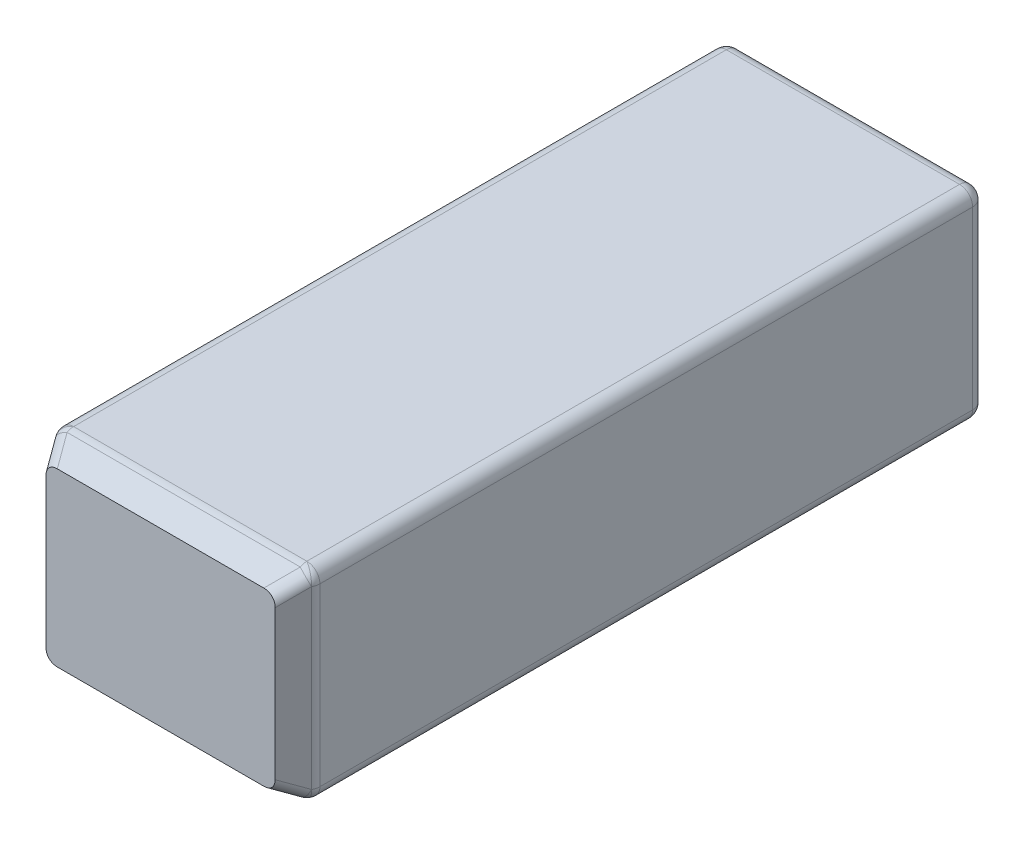
ISO-10303-21;
HEADER;
FILE_DESCRIPTION(('STEP AP214'),'2;1');
FILE_NAME('part.step','',(''),(''),'','','');
FILE_SCHEMA(('AUTOMOTIVE_DESIGN { 1 0 10303 214 1 1 1 1 }'));
ENDSEC;
DATA;
#1=APPLICATION_CONTEXT('core data for automotive mechanical design processes');
#2=APPLICATION_PROTOCOL_DEFINITION('international standard','automotive_design',2000,#1);
#3=PRODUCT_CONTEXT('',#1,'mechanical');
#4=PRODUCT('Part','Part','',(#3));
#5=PRODUCT_RELATED_PRODUCT_CATEGORY('part','',(#4));
#6=PRODUCT_DEFINITION_FORMATION('','',#4);
#7=PRODUCT_DEFINITION_CONTEXT('part definition',#1,'design');
#8=PRODUCT_DEFINITION('design','',#6,#7);
#9=PRODUCT_DEFINITION_SHAPE('','',#8);
#10=(LENGTH_UNIT() NAMED_UNIT(*) SI_UNIT(.MILLI.,.METRE.));
#11=(NAMED_UNIT(*) PLANE_ANGLE_UNIT() SI_UNIT($,.RADIAN.));
#12=(NAMED_UNIT(*) SI_UNIT($,.STERADIAN.) SOLID_ANGLE_UNIT());
#13=UNCERTAINTY_MEASURE_WITH_UNIT(LENGTH_MEASURE(1.E-05),#10,'distance_accuracy_value','');
#14=(GEOMETRIC_REPRESENTATION_CONTEXT(3) GLOBAL_UNCERTAINTY_ASSIGNED_CONTEXT((#13)) GLOBAL_UNIT_ASSIGNED_CONTEXT((#10,
#11,#12)) REPRESENTATION_CONTEXT('',''));
#15=CARTESIAN_POINT('',(0.,0.,0.));
#16=DIRECTION('',(0.,0.,1.));
#17=DIRECTION('',(1.,0.,0.));
#18=AXIS2_PLACEMENT_3D('',#15,#16,#17);
#19=CARTESIAN_POINT('',(31.496,-24.511,168.91));
#20=DIRECTION('',(-1.,0.,0.));
#21=DIRECTION('',(0.,0.,1.));
#22=AXIS2_PLACEMENT_3D('',#19,#20,#21);
#23=PLANE('',#22);
#24=DIRECTION('',(0.,0.,-1.));
#25=VECTOR('',#24,1.);
#26=CARTESIAN_POINT('',(31.496,-21.336,168.91));
#27=LINE('',#26,#25);
#28=CARTESIAN_POINT('',(31.496,-21.336,161.709261314031));
#29=VERTEX_POINT('',#28);
#30=CARTESIAN_POINT('',(31.496,-21.336,3.17500000000001));
#31=VERTEX_POINT('',#30);
#32=EDGE_CURVE('E231',#29,#31,#27,.T.);
#33=ORIENTED_EDGE('',*,*,#32,.T.);
#34=DIRECTION('',(0.,1.,0.));
#35=VECTOR('',#34,1.);
#36=CARTESIAN_POINT('',(31.496,21.336,3.17500000000001));
#37=LINE('',#36,#35);
#38=CARTESIAN_POINT('',(31.496,21.336,3.17500000000001));
#39=VERTEX_POINT('',#38);
#40=EDGE_CURVE('E11',#31,#39,#37,.T.);
#41=ORIENTED_EDGE('',*,*,#40,.T.);
#42=DIRECTION('',(0.,0.,-1.));
#43=VECTOR('',#42,1.);
#44=CARTESIAN_POINT('',(31.496,21.336,168.91));
#45=LINE('',#44,#43);
#46=CARTESIAN_POINT('',(31.496,21.336,161.709261314031));
#47=VERTEX_POINT('',#46);
#48=EDGE_CURVE('E228',#39,#47,#45,.F.);
#49=ORIENTED_EDGE('',*,*,#48,.T.);
#50=DIRECTION('',(0.,1.,0.));
#51=VECTOR('',#50,1.);
#52=CARTESIAN_POINT('',(31.496,-21.336,161.709261314031));
#53=LINE('',#52,#51);
#54=EDGE_CURVE('E54',#47,#29,#53,.F.);
#55=ORIENTED_EDGE('',*,*,#54,.T.);
#56=EDGE_LOOP('',(#33,#41,#49,#55));
#57=FACE_BOUND('',#56,.T.);
#58=ADVANCED_FACE('F45',(#57),#23,.F.);
#59=CARTESIAN_POINT('',(-31.496,24.511,168.91));
#60=DIRECTION('',(0.,-1.,0.));
#61=DIRECTION('',(0.,0.,-1.));
#62=AXIS2_PLACEMENT_3D('',#59,#60,#61);
#63=PLANE('',#62);
#64=DIRECTION('',(0.,0.,-1.));
#65=VECTOR('',#64,1.);
#66=CARTESIAN_POINT('',(28.321,24.511,168.91));
#67=LINE('',#66,#65);
#68=CARTESIAN_POINT('',(28.321,24.511,161.709261314031));
#69=VERTEX_POINT('',#68);
#70=CARTESIAN_POINT('',(28.321,24.511,3.17500000000001));
#71=VERTEX_POINT('',#70);
#72=EDGE_CURVE('E239',#69,#71,#67,.T.);
#73=ORIENTED_EDGE('',*,*,#72,.T.);
#74=DIRECTION('',(-1.,0.,0.));
#75=VECTOR('',#74,1.);
#76=CARTESIAN_POINT('',(-31.496,24.511,3.17500000000001));
#77=LINE('',#76,#75);
#78=CARTESIAN_POINT('',(-28.321,24.511,3.17500000000001));
#79=VERTEX_POINT('',#78);
#80=EDGE_CURVE('E242',#71,#79,#77,.T.);
#81=ORIENTED_EDGE('',*,*,#80,.T.);
#82=DIRECTION('',(0.,0.,-1.));
#83=VECTOR('',#82,1.);
#84=CARTESIAN_POINT('',(-28.321,24.511,168.91));
#85=LINE('',#84,#83);
#86=CARTESIAN_POINT('',(-28.321,24.511,161.709261314031));
#87=VERTEX_POINT('',#86);
#88=EDGE_CURVE('E233',#79,#87,#85,.F.);
#89=ORIENTED_EDGE('',*,*,#88,.T.);
#90=DIRECTION('',(-1.,0.,0.));
#91=VECTOR('',#90,1.);
#92=CARTESIAN_POINT('',(31.496,24.511,161.709261314031));
#93=LINE('',#92,#91);
#94=EDGE_CURVE('E236',#87,#69,#93,.F.);
#95=ORIENTED_EDGE('',*,*,#94,.T.);
#96=EDGE_LOOP('',(#73,#81,#89,#95));
#97=FACE_BOUND('',#96,.T.);
#98=ADVANCED_FACE('F465',(#97),#63,.F.);
#99=CARTESIAN_POINT('',(-31.496,-24.511,168.91));
#100=DIRECTION('',(1.,0.,0.));
#101=DIRECTION('',(0.,0.,-1.));
#102=AXIS2_PLACEMENT_3D('',#99,#100,#101);
#103=PLANE('',#102);
#104=DIRECTION('',(0.,0.,-1.));
#105=VECTOR('',#104,1.);
#106=CARTESIAN_POINT('',(-31.496,-21.336,168.91));
#107=LINE('',#106,#105);
#108=CARTESIAN_POINT('',(-31.496,-21.336,3.17500000000001));
#109=VERTEX_POINT('',#108);
#110=CARTESIAN_POINT('',(-31.496,-21.336,161.709261314031));
#111=VERTEX_POINT('',#110);
#112=EDGE_CURVE('E222',#109,#111,#107,.F.);
#113=ORIENTED_EDGE('',*,*,#112,.T.);
#114=DIRECTION('',(0.,-1.,0.));
#115=VECTOR('',#114,1.);
#116=CARTESIAN_POINT('',(-31.496,21.336,161.709261314031));
#117=LINE('',#116,#115);
#118=CARTESIAN_POINT('',(-31.496,21.336,161.709261314031));
#119=VERTEX_POINT('',#118);
#120=EDGE_CURVE('E298',#111,#119,#117,.F.);
#121=ORIENTED_EDGE('',*,*,#120,.T.);
#122=DIRECTION('',(0.,0.,-1.));
#123=VECTOR('',#122,1.);
#124=CARTESIAN_POINT('',(-31.496,21.336,168.91));
#125=LINE('',#124,#123);
#126=CARTESIAN_POINT('',(-31.496,21.336,3.17500000000001));
#127=VERTEX_POINT('',#126);
#128=EDGE_CURVE('E219',#119,#127,#125,.T.);
#129=ORIENTED_EDGE('',*,*,#128,.T.);
#130=DIRECTION('',(0.,-1.,0.));
#131=VECTOR('',#130,1.);
#132=CARTESIAN_POINT('',(-31.496,-21.336,3.17500000000001));
#133=LINE('',#132,#131);
#134=EDGE_CURVE('E296',#127,#109,#133,.T.);
#135=ORIENTED_EDGE('',*,*,#134,.T.);
#136=EDGE_LOOP('',(#113,#121,#129,#135));
#137=FACE_BOUND('',#136,.T.);
#138=ADVANCED_FACE('F418',(#137),#103,.F.);
#139=CARTESIAN_POINT('',(-31.496,-24.511,168.91));
#140=DIRECTION('',(0.,1.,0.));
#141=DIRECTION('',(0.,0.,1.));
#142=AXIS2_PLACEMENT_3D('',#139,#140,#141);
#143=PLANE('',#142);
#144=DIRECTION('',(0.,0.,-1.));
#145=VECTOR('',#144,1.);
#146=CARTESIAN_POINT('',(-28.321,-24.511,168.91));
#147=LINE('',#146,#145);
#148=CARTESIAN_POINT('',(-28.321,-24.511,161.709261314031));
#149=VERTEX_POINT('',#148);
#150=CARTESIAN_POINT('',(-28.321,-24.511,3.17500000000001));
#151=VERTEX_POINT('',#150);
#152=EDGE_CURVE('E210',#149,#151,#147,.T.);
#153=ORIENTED_EDGE('',*,*,#152,.T.);
#154=DIRECTION('',(1.,0.,0.));
#155=VECTOR('',#154,1.);
#156=CARTESIAN_POINT('',(31.496,-24.511,3.17500000000001));
#157=LINE('',#156,#155);
#158=CARTESIAN_POINT('',(28.321,-24.511,3.17500000000001));
#159=VERTEX_POINT('',#158);
#160=EDGE_CURVE('E190',#151,#159,#157,.T.);
#161=ORIENTED_EDGE('',*,*,#160,.T.);
#162=DIRECTION('',(0.,0.,-1.));
#163=VECTOR('',#162,1.);
#164=CARTESIAN_POINT('',(28.321,-24.511,168.91));
#165=LINE('',#164,#163);
#166=CARTESIAN_POINT('',(28.321,-24.511,161.709261314031));
#167=VERTEX_POINT('',#166);
#168=EDGE_CURVE('E198',#159,#167,#165,.F.);
#169=ORIENTED_EDGE('',*,*,#168,.T.);
#170=DIRECTION('',(1.,0.,0.));
#171=VECTOR('',#170,1.);
#172=CARTESIAN_POINT('',(-31.496,-24.511,161.709261314031));
#173=LINE('',#172,#171);
#174=EDGE_CURVE('E204',#167,#149,#173,.F.);
#175=ORIENTED_EDGE('',*,*,#174,.T.);
#176=EDGE_LOOP('',(#153,#161,#169,#175));
#177=FACE_BOUND('',#176,.T.);
#178=ADVANCED_FACE('F208',(#177),#143,.F.);
#179=CARTESIAN_POINT('',(0.,0.,168.91));
#180=DIRECTION('',(0.,0.,-1.));
#181=DIRECTION('',(-1.,0.,0.));
#182=AXIS2_PLACEMENT_3D('',#179,#180,#181);
#183=PLANE('',#182);
#184=DIRECTION('',(0.,-1.,0.));
#185=VECTOR('',#184,1.);
#186=CARTESIAN_POINT('',(-27.8298257906459,0.,168.91));
#187=LINE('',#186,#185);
#188=CARTESIAN_POINT('',(-27.8298257906459,18.0951951336303,168.91));
#189=VERTEX_POINT('',#188);
#190=CARTESIAN_POINT('',(-27.8298257906459,-18.0951951336303,168.91));
#191=VERTEX_POINT('',#190);
#192=EDGE_CURVE('E371',#189,#191,#187,.T.);
#193=ORIENTED_EDGE('',*,*,#192,.T.);
#194=CARTESIAN_POINT('',(-24.1636515812917,-17.1786515812918,168.91));
#195=DIRECTION('',(0.,0.,-1.));
#196=DIRECTION('',(0.707106781186548,0.707106781186548,0.));
#197=AXIS2_PLACEMENT_3D('',#194,#195,#196);
#198=ELLIPSE('',#197,4.09890737473618,3.175);
#199=CARTESIAN_POINT('',(-25.0801951336303,-20.8448257906459,168.91));
#200=VERTEX_POINT('',#199);
#201=EDGE_CURVE('E261',#191,#200,#198,.F.);
#202=ORIENTED_EDGE('',*,*,#201,.T.);
#203=DIRECTION('',(1.,0.,0.));
#204=VECTOR('',#203,1.);
#205=CARTESIAN_POINT('',(0.,-20.8448257906459,168.91));
#206=LINE('',#205,#204);
#207=CARTESIAN_POINT('',(25.0801951336303,-20.8448257906459,168.91));
#208=VERTEX_POINT('',#207);
#209=EDGE_CURVE('E205',#200,#208,#206,.T.);
#210=ORIENTED_EDGE('',*,*,#209,.T.);
#211=CARTESIAN_POINT('',(24.1636515812918,-17.1786515812918,168.91));
#212=DIRECTION('',(0.,0.,-1.));
#213=DIRECTION('',(-0.707106781186548,0.707106781186548,0.));
#214=AXIS2_PLACEMENT_3D('',#211,#212,#213);
#215=ELLIPSE('',#214,4.09890737473618,3.175);
#216=CARTESIAN_POINT('',(27.8298257906459,-18.0951951336303,168.91));
#217=VERTEX_POINT('',#216);
#218=EDGE_CURVE('E255',#208,#217,#215,.F.);
#219=ORIENTED_EDGE('',*,*,#218,.T.);
#220=DIRECTION('',(0.,1.,0.));
#221=VECTOR('',#220,1.);
#222=CARTESIAN_POINT('',(27.8298257906459,0.,168.91));
#223=LINE('',#222,#221);
#224=CARTESIAN_POINT('',(27.8298257906459,18.0951951336303,168.91));
#225=VERTEX_POINT('',#224);
#226=EDGE_CURVE('E328',#217,#225,#223,.T.);
#227=ORIENTED_EDGE('',*,*,#226,.T.);
#228=CARTESIAN_POINT('',(24.1636515812918,17.1786515812918,168.91));
#229=DIRECTION('',(0.,0.,-1.));
#230=DIRECTION('',(-0.707106781186548,-0.707106781186548,0.));
#231=AXIS2_PLACEMENT_3D('',#228,#229,#230);
#232=ELLIPSE('',#231,4.09890737473618,3.175);
#233=CARTESIAN_POINT('',(25.0801951336303,20.8448257906459,168.91));
#234=VERTEX_POINT('',#233);
#235=EDGE_CURVE('E257',#225,#234,#232,.F.);
#236=ORIENTED_EDGE('',*,*,#235,.T.);
#237=DIRECTION('',(-1.,0.,0.));
#238=VECTOR('',#237,1.);
#239=CARTESIAN_POINT('',(0.,20.8448257906459,168.91));
#240=LINE('',#239,#238);
#241=CARTESIAN_POINT('',(-25.0801951336303,20.8448257906459,168.91));
#242=VERTEX_POINT('',#241);
#243=EDGE_CURVE('E373',#234,#242,#240,.T.);
#244=ORIENTED_EDGE('',*,*,#243,.T.);
#245=CARTESIAN_POINT('',(-24.1636515812917,17.1786515812917,168.91));
#246=DIRECTION('',(0.,0.,-1.));
#247=DIRECTION('',(0.707106781186548,-0.707106781186548,0.));
#248=AXIS2_PLACEMENT_3D('',#245,#246,#247);
#249=ELLIPSE('',#248,4.09890737473618,3.175);
#250=EDGE_CURVE('E259',#242,#189,#249,.F.);
#251=ORIENTED_EDGE('',*,*,#250,.T.);
#252=EDGE_LOOP('',(#193,#202,#210,#219,#227,#236,#244,#251));
#253=FACE_BOUND('',#252,.T.);
#254=ADVANCED_FACE('F369',(#253),#183,.F.);
#255=CARTESIAN_POINT('',(0.,0.,0.));
#256=DIRECTION('',(0.,0.,-1.));
#257=DIRECTION('',(-1.,0.,0.));
#258=AXIS2_PLACEMENT_3D('',#255,#256,#257);
#259=PLANE('',#258);
#260=DIRECTION('',(1.,0.,0.));
#261=VECTOR('',#260,1.);
#262=CARTESIAN_POINT('',(-31.496,-21.336,0.));
#263=LINE('',#262,#261);
#264=CARTESIAN_POINT('',(28.321,-21.336,0.));
#265=VERTEX_POINT('',#264);
#266=CARTESIAN_POINT('',(-28.321,-21.336,0.));
#267=VERTEX_POINT('',#266);
#268=EDGE_CURVE('E193',#265,#267,#263,.F.);
#269=ORIENTED_EDGE('',*,*,#268,.T.);
#270=DIRECTION('',(0.,-1.,0.));
#271=VECTOR('',#270,1.);
#272=CARTESIAN_POINT('',(-28.321,21.336,0.));
#273=LINE('',#272,#271);
#274=CARTESIAN_POINT('',(-28.321,21.336,0.));
#275=VERTEX_POINT('',#274);
#276=EDGE_CURVE('E306',#267,#275,#273,.F.);
#277=ORIENTED_EDGE('',*,*,#276,.T.);
#278=DIRECTION('',(-1.,0.,0.));
#279=VECTOR('',#278,1.);
#280=CARTESIAN_POINT('',(31.496,21.336,0.));
#281=LINE('',#280,#279);
#282=CARTESIAN_POINT('',(28.321,21.336,0.));
#283=VERTEX_POINT('',#282);
#284=EDGE_CURVE('E211',#275,#283,#281,.F.);
#285=ORIENTED_EDGE('',*,*,#284,.T.);
#286=DIRECTION('',(0.,1.,0.));
#287=VECTOR('',#286,1.);
#288=CARTESIAN_POINT('',(28.321,-21.336,0.));
#289=LINE('',#288,#287);
#290=EDGE_CURVE('E304',#283,#265,#289,.F.);
#291=ORIENTED_EDGE('',*,*,#290,.T.);
#292=EDGE_LOOP('',(#269,#277,#285,#291));
#293=FACE_BOUND('',#292,.T.);
#294=ADVANCED_FACE('F440',(#293),#259,.T.);
#295=CARTESIAN_POINT('',(0.,20.8448257906459,168.91));
#296=DIRECTION('',(0.,-0.866025403784439,-0.499999999999999));
#297=DIRECTION('',(-1.,0.,0.));
#298=AXIS2_PLACEMENT_3D('',#295,#296,#297);
#299=PLANE('',#298);
#300=DIRECTION('',(1.,0.,0.));
#301=VECTOR('',#300,1.);
#302=CARTESIAN_POINT('',(-31.496,24.0856306570156,163.296761314031));
#303=LINE('',#302,#301);
#304=CARTESIAN_POINT('',(28.321,24.0856306570156,163.296761314031));
#305=VERTEX_POINT('',#304);
#306=CARTESIAN_POINT('',(-28.321,24.0856306570156,163.296761314031));
#307=VERTEX_POINT('',#306);
#308=EDGE_CURVE('E245',#305,#307,#303,.F.);
#309=ORIENTED_EDGE('',*,*,#308,.T.);
#310=DIRECTION('',(-0.447213595499957,0.447213595499957,-0.774596669241484));
#311=VECTOR('',#310,1.);
#312=CARTESIAN_POINT('',(-20.0641561069042,15.8287867639198,177.598034447038));
#313=LINE('',#312,#311);
#314=EDGE_CURVE('E269',#307,#242,#313,.F.);
#315=ORIENTED_EDGE('',*,*,#314,.T.);
#316=ORIENTED_EDGE('',*,*,#243,.F.);
#317=DIRECTION('',(0.447213595499957,0.447213595499957,-0.774596669241484));
#318=VECTOR('',#317,1.);
#319=CARTESIAN_POINT('',(20.0641561069042,15.8287867639198,177.598034447038));
#320=LINE('',#319,#318);
#321=EDGE_CURVE('E267',#234,#305,#320,.T.);
#322=ORIENTED_EDGE('',*,*,#321,.T.);
#323=EDGE_LOOP('',(#309,#315,#316,#322));
#324=FACE_BOUND('',#323,.T.);
#325=ADVANCED_FACE('F492',(#324),#299,.F.);
#326=CARTESIAN_POINT('',(-27.8298257906459,0.,168.91));
#327=DIRECTION('',(0.866025403784439,0.,-0.499999999999999));
#328=DIRECTION('',(0.,-1.,0.));
#329=AXIS2_PLACEMENT_3D('',#326,#327,#328);
#330=PLANE('',#329);
#331=DIRECTION('',(0.,1.,0.));
#332=VECTOR('',#331,1.);
#333=CARTESIAN_POINT('',(-31.0706306570156,-21.336,163.296761314031));
#334=LINE('',#333,#332);
#335=CARTESIAN_POINT('',(-31.0706306570156,21.336,163.296761314031));
#336=VERTEX_POINT('',#335);
#337=CARTESIAN_POINT('',(-31.0706306570156,-21.336,163.296761314031));
#338=VERTEX_POINT('',#337);
#339=EDGE_CURVE('E248',#336,#338,#334,.F.);
#340=ORIENTED_EDGE('',*,*,#339,.T.);
#341=DIRECTION('',(-0.447213595499957,-0.447213595499957,-0.774596669241484));
#342=VECTOR('',#341,1.);
#343=CARTESIAN_POINT('',(-24.2107867639198,-14.4761561069042,175.178359468864));
#344=LINE('',#343,#342);
#345=EDGE_CURVE('E252',#338,#191,#344,.F.);
#346=ORIENTED_EDGE('',*,*,#345,.T.);
#347=ORIENTED_EDGE('',*,*,#192,.F.);
#348=DIRECTION('',(-0.447213595499957,0.447213595499957,-0.774596669241484));
#349=VECTOR('',#348,1.);
#350=CARTESIAN_POINT('',(-24.2107867639198,14.4761561069042,175.178359468864));
#351=LINE('',#350,#349);
#352=EDGE_CURVE('E250',#189,#336,#351,.T.);
#353=ORIENTED_EDGE('',*,*,#352,.T.);
#354=EDGE_LOOP('',(#340,#346,#347,#353));
#355=FACE_BOUND('',#354,.T.);
#356=ADVANCED_FACE('F395',(#355),#330,.F.);
#357=CARTESIAN_POINT('',(27.8298257906459,0.,168.91));
#358=DIRECTION('',(-0.866025403784439,0.,-0.499999999999999));
#359=DIRECTION('',(0.,1.,0.));
#360=AXIS2_PLACEMENT_3D('',#357,#358,#359);
#361=PLANE('',#360);
#362=DIRECTION('',(0.,-1.,0.));
#363=VECTOR('',#362,1.);
#364=CARTESIAN_POINT('',(31.0706306570156,21.336,163.296761314031));
#365=LINE('',#364,#363);
#366=CARTESIAN_POINT('',(31.0706306570156,-21.336,163.296761314031));
#367=VERTEX_POINT('',#366);
#368=CARTESIAN_POINT('',(31.0706306570156,21.336,163.296761314031));
#369=VERTEX_POINT('',#368);
#370=EDGE_CURVE('E62',#367,#369,#365,.F.);
#371=ORIENTED_EDGE('',*,*,#370,.T.);
#372=DIRECTION('',(0.447213595499957,0.447213595499957,-0.774596669241484));
#373=VECTOR('',#372,1.);
#374=CARTESIAN_POINT('',(24.2107867639198,14.4761561069042,175.178359468864));
#375=LINE('',#374,#373);
#376=EDGE_CURVE('E290',#369,#225,#375,.F.);
#377=ORIENTED_EDGE('',*,*,#376,.T.);
#378=ORIENTED_EDGE('',*,*,#226,.F.);
#379=DIRECTION('',(0.447213595499957,-0.447213595499957,-0.774596669241484));
#380=VECTOR('',#379,1.);
#381=CARTESIAN_POINT('',(24.2107867639198,-14.4761561069042,175.178359468864));
#382=LINE('',#381,#380);
#383=EDGE_CURVE('E67',#217,#367,#382,.T.);
#384=ORIENTED_EDGE('',*,*,#383,.T.);
#385=EDGE_LOOP('',(#371,#377,#378,#384));
#386=FACE_BOUND('',#385,.T.);
#387=ADVANCED_FACE('F481',(#386),#361,.F.);
#388=CARTESIAN_POINT('',(0.,-20.8448257906459,168.91));
#389=DIRECTION('',(0.,0.866025403784439,-0.499999999999999));
#390=DIRECTION('',(1.,0.,0.));
#391=AXIS2_PLACEMENT_3D('',#388,#389,#390);
#392=PLANE('',#391);
#393=ORIENTED_EDGE('',*,*,#209,.F.);
#394=DIRECTION('',(-0.447213595499957,-0.447213595499957,-0.774596669241484));
#395=VECTOR('',#394,1.);
#396=CARTESIAN_POINT('',(-20.0641561069042,-15.8287867639198,177.598034447038));
#397=LINE('',#396,#395);
#398=CARTESIAN_POINT('',(-28.321,-24.0856306570156,163.296761314031));
#399=VERTEX_POINT('',#398);
#400=EDGE_CURVE('E265',#200,#399,#397,.T.);
#401=ORIENTED_EDGE('',*,*,#400,.T.);
#402=DIRECTION('',(-1.,0.,0.));
#403=VECTOR('',#402,1.);
#404=CARTESIAN_POINT('',(31.496,-24.0856306570156,163.296761314031));
#405=LINE('',#404,#403);
#406=CARTESIAN_POINT('',(28.321,-24.0856306570156,163.296761314031));
#407=VERTEX_POINT('',#406);
#408=EDGE_CURVE('E225',#399,#407,#405,.F.);
#409=ORIENTED_EDGE('',*,*,#408,.T.);
#410=DIRECTION('',(0.447213595499957,-0.447213595499957,-0.774596669241484));
#411=VECTOR('',#410,1.);
#412=CARTESIAN_POINT('',(20.0641561069042,-15.8287867639198,177.598034447038));
#413=LINE('',#412,#411);
#414=EDGE_CURVE('E263',#407,#208,#413,.F.);
#415=ORIENTED_EDGE('',*,*,#414,.T.);
#416=EDGE_LOOP('',(#393,#401,#409,#415));
#417=FACE_BOUND('',#416,.T.);
#418=ADVANCED_FACE('F364',(#417),#392,.F.);
#419=CARTESIAN_POINT('',(-31.496,-21.336,161.709261314031));
#420=DIRECTION('',(-1.,0.,0.));
#421=DIRECTION('',(0.,0.,1.));
#422=AXIS2_PLACEMENT_3D('',#419,#420,#421);
#423=CYLINDRICAL_SURFACE('',#422,3.175);
#424=ORIENTED_EDGE('',*,*,#408,.F.);
#425=CARTESIAN_POINT('',(-28.321,-21.336,161.709261314031));
#426=DIRECTION('',(-1.,0.,0.));
#427=DIRECTION('',(0.,0.,1.));
#428=AXIS2_PLACEMENT_3D('',#425,#426,#427);
#429=CIRCLE('',#428,3.175);
#430=EDGE_CURVE('E294',#399,#149,#429,.F.);
#431=ORIENTED_EDGE('',*,*,#430,.T.);
#432=ORIENTED_EDGE('',*,*,#174,.F.);
#433=CARTESIAN_POINT('',(28.321,-21.336,161.709261314031));
#434=DIRECTION('',(-1.,0.,0.));
#435=DIRECTION('',(0.,0.,1.));
#436=AXIS2_PLACEMENT_3D('',#433,#434,#435);
#437=CIRCLE('',#436,3.175);
#438=EDGE_CURVE('E292',#167,#407,#437,.T.);
#439=ORIENTED_EDGE('',*,*,#438,.T.);
#440=EDGE_LOOP('',(#424,#431,#432,#439));
#441=FACE_BOUND('',#440,.T.);
#442=ADVANCED_FACE('F480',(#441),#423,.T.);
#443=CARTESIAN_POINT('',(-28.321,-21.336,168.91));
#444=DIRECTION('',(0.,0.,-1.));
#445=DIRECTION('',(-1.,0.,0.));
#446=AXIS2_PLACEMENT_3D('',#443,#444,#445);
#447=CYLINDRICAL_SURFACE('',#446,3.175);
#448=ORIENTED_EDGE('',*,*,#112,.F.);
#449=CARTESIAN_POINT('',(-28.321,-21.336,3.17500000000001));
#450=DIRECTION('',(0.,0.,-1.));
#451=DIRECTION('',(-1.,0.,0.));
#452=AXIS2_PLACEMENT_3D('',#449,#450,#451);
#453=CIRCLE('',#452,3.175);
#454=EDGE_CURVE('E282',#109,#151,#453,.F.);
#455=ORIENTED_EDGE('',*,*,#454,.T.);
#456=ORIENTED_EDGE('',*,*,#152,.F.);
#457=CARTESIAN_POINT('',(-28.321,-21.336,161.709261314031));
#458=DIRECTION('',(0.,0.,-1.));
#459=DIRECTION('',(-1.,0.,0.));
#460=AXIS2_PLACEMENT_3D('',#457,#458,#459);
#461=CIRCLE('',#460,3.175);
#462=EDGE_CURVE('E280',#149,#111,#461,.T.);
#463=ORIENTED_EDGE('',*,*,#462,.T.);
#464=EDGE_LOOP('',(#448,#455,#456,#463));
#465=FACE_BOUND('',#464,.T.);
#466=ADVANCED_FACE('F380',(#465),#447,.T.);
#467=CARTESIAN_POINT('',(28.321,-21.336,168.91));
#468=DIRECTION('',(0.,0.,-1.));
#469=DIRECTION('',(-1.,0.,0.));
#470=AXIS2_PLACEMENT_3D('',#467,#468,#469);
#471=CYLINDRICAL_SURFACE('',#470,3.175);
#472=ORIENTED_EDGE('',*,*,#168,.F.);
#473=CARTESIAN_POINT('',(28.321,-21.336,3.17500000000001));
#474=DIRECTION('',(0.,0.,-1.));
#475=DIRECTION('',(-1.,0.,0.));
#476=AXIS2_PLACEMENT_3D('',#473,#474,#475);
#477=CIRCLE('',#476,3.175);
#478=EDGE_CURVE('E172',#159,#31,#477,.F.);
#479=ORIENTED_EDGE('',*,*,#478,.T.);
#480=ORIENTED_EDGE('',*,*,#32,.F.);
#481=CARTESIAN_POINT('',(28.321,-21.336,161.709261314031));
#482=DIRECTION('',(0.,0.,-1.));
#483=DIRECTION('',(-1.,0.,0.));
#484=AXIS2_PLACEMENT_3D('',#481,#482,#483);
#485=CIRCLE('',#484,3.175);
#486=EDGE_CURVE('E183',#29,#167,#485,.T.);
#487=ORIENTED_EDGE('',*,*,#486,.T.);
#488=EDGE_LOOP('',(#472,#479,#480,#487));
#489=FACE_BOUND('',#488,.T.);
#490=ADVANCED_FACE('F199',(#489),#471,.T.);
#491=CARTESIAN_POINT('',(-31.496,-21.336,3.17500000000001));
#492=DIRECTION('',(-1.,0.,0.));
#493=DIRECTION('',(0.,0.,1.));
#494=AXIS2_PLACEMENT_3D('',#491,#492,#493);
#495=CYLINDRICAL_SURFACE('',#494,3.175);
#496=ORIENTED_EDGE('',*,*,#160,.F.);
#497=CARTESIAN_POINT('',(-28.321,-21.336,3.17500000000001));
#498=DIRECTION('',(-1.,0.,0.));
#499=DIRECTION('',(0.,0.,1.));
#500=AXIS2_PLACEMENT_3D('',#497,#498,#499);
#501=CIRCLE('',#500,3.175);
#502=EDGE_CURVE('E194',#151,#267,#501,.F.);
#503=ORIENTED_EDGE('',*,*,#502,.T.);
#504=ORIENTED_EDGE('',*,*,#268,.F.);
#505=CARTESIAN_POINT('',(28.321,-21.336,3.17500000000001));
#506=DIRECTION('',(-1.,0.,0.));
#507=DIRECTION('',(0.,0.,1.));
#508=AXIS2_PLACEMENT_3D('',#505,#506,#507);
#509=CIRCLE('',#508,3.175);
#510=EDGE_CURVE('E175',#265,#159,#509,.T.);
#511=ORIENTED_EDGE('',*,*,#510,.T.);
#512=EDGE_LOOP('',(#496,#503,#504,#511));
#513=FACE_BOUND('',#512,.T.);
#514=ADVANCED_FACE('F188',(#513),#495,.T.);
#515=CARTESIAN_POINT('',(-31.496,21.336,161.709261314031));
#516=DIRECTION('',(1.,0.,0.));
#517=DIRECTION('',(0.,0.,-1.));
#518=AXIS2_PLACEMENT_3D('',#515,#516,#517);
#519=CYLINDRICAL_SURFACE('',#518,3.175);
#520=ORIENTED_EDGE('',*,*,#94,.F.);
#521=CARTESIAN_POINT('',(-28.321,21.336,161.709261314031));
#522=DIRECTION('',(1.,0.,0.));
#523=DIRECTION('',(0.,0.,-1.));
#524=AXIS2_PLACEMENT_3D('',#521,#522,#523);
#525=CIRCLE('',#524,3.175);
#526=EDGE_CURVE('E302',#87,#307,#525,.T.);
#527=ORIENTED_EDGE('',*,*,#526,.T.);
#528=ORIENTED_EDGE('',*,*,#308,.F.);
#529=CARTESIAN_POINT('',(28.321,21.336,161.709261314031));
#530=DIRECTION('',(1.,0.,0.));
#531=DIRECTION('',(0.,0.,-1.));
#532=AXIS2_PLACEMENT_3D('',#529,#530,#531);
#533=CIRCLE('',#532,3.175);
#534=EDGE_CURVE('E300',#305,#69,#533,.F.);
#535=ORIENTED_EDGE('',*,*,#534,.T.);
#536=EDGE_LOOP('',(#520,#527,#528,#535));
#537=FACE_BOUND('',#536,.T.);
#538=ADVANCED_FACE('F500',(#537),#519,.T.);
#539=CARTESIAN_POINT('',(28.321,21.336,168.91));
#540=DIRECTION('',(0.,0.,-1.));
#541=DIRECTION('',(-1.,0.,0.));
#542=AXIS2_PLACEMENT_3D('',#539,#540,#541);
#543=CYLINDRICAL_SURFACE('',#542,3.175);
#544=ORIENTED_EDGE('',*,*,#48,.F.);
#545=CARTESIAN_POINT('',(28.321,21.336,3.17500000000001));
#546=DIRECTION('',(0.,0.,-1.));
#547=DIRECTION('',(-1.,0.,0.));
#548=AXIS2_PLACEMENT_3D('',#545,#546,#547);
#549=CIRCLE('',#548,3.175);
#550=EDGE_CURVE('E286',#39,#71,#549,.F.);
#551=ORIENTED_EDGE('',*,*,#550,.T.);
#552=ORIENTED_EDGE('',*,*,#72,.F.);
#553=CARTESIAN_POINT('',(28.321,21.336,161.709261314031));
#554=DIRECTION('',(0.,0.,-1.));
#555=DIRECTION('',(-1.,0.,0.));
#556=AXIS2_PLACEMENT_3D('',#553,#554,#555);
#557=CIRCLE('',#556,3.175);
#558=EDGE_CURVE('E182',#69,#47,#557,.T.);
#559=ORIENTED_EDGE('',*,*,#558,.T.);
#560=EDGE_LOOP('',(#544,#551,#552,#559));
#561=FACE_BOUND('',#560,.T.);
#562=ADVANCED_FACE('F450',(#561),#543,.T.);
#563=CARTESIAN_POINT('',(-28.321,21.336,168.91));
#564=DIRECTION('',(0.,0.,-1.));
#565=DIRECTION('',(-1.,0.,0.));
#566=AXIS2_PLACEMENT_3D('',#563,#564,#565);
#567=CYLINDRICAL_SURFACE('',#566,3.175);
#568=ORIENTED_EDGE('',*,*,#88,.F.);
#569=CARTESIAN_POINT('',(-28.321,21.336,3.17500000000001));
#570=DIRECTION('',(0.,0.,-1.));
#571=DIRECTION('',(-1.,0.,0.));
#572=AXIS2_PLACEMENT_3D('',#569,#570,#571);
#573=CIRCLE('',#572,3.175);
#574=EDGE_CURVE('E195',#79,#127,#573,.F.);
#575=ORIENTED_EDGE('',*,*,#574,.T.);
#576=ORIENTED_EDGE('',*,*,#128,.F.);
#577=CARTESIAN_POINT('',(-28.321,21.336,161.709261314031));
#578=DIRECTION('',(0.,0.,-1.));
#579=DIRECTION('',(-1.,0.,0.));
#580=AXIS2_PLACEMENT_3D('',#577,#578,#579);
#581=CIRCLE('',#580,3.175);
#582=EDGE_CURVE('E276',#119,#87,#581,.T.);
#583=ORIENTED_EDGE('',*,*,#582,.T.);
#584=EDGE_LOOP('',(#568,#575,#576,#583));
#585=FACE_BOUND('',#584,.T.);
#586=ADVANCED_FACE('F422',(#585),#567,.T.);
#587=CARTESIAN_POINT('',(-31.496,21.336,3.17500000000001));
#588=DIRECTION('',(1.,0.,0.));
#589=DIRECTION('',(0.,0.,-1.));
#590=AXIS2_PLACEMENT_3D('',#587,#588,#589);
#591=CYLINDRICAL_SURFACE('',#590,3.175);
#592=ORIENTED_EDGE('',*,*,#284,.F.);
#593=CARTESIAN_POINT('',(-28.321,21.336,3.17500000000001));
#594=DIRECTION('',(1.,0.,0.));
#595=DIRECTION('',(0.,0.,-1.));
#596=AXIS2_PLACEMENT_3D('',#593,#594,#595);
#597=CIRCLE('',#596,3.175);
#598=EDGE_CURVE('E273',#275,#79,#597,.T.);
#599=ORIENTED_EDGE('',*,*,#598,.T.);
#600=ORIENTED_EDGE('',*,*,#80,.F.);
#601=CARTESIAN_POINT('',(28.321,21.336,3.17500000000001));
#602=DIRECTION('',(1.,0.,0.));
#603=DIRECTION('',(0.,0.,-1.));
#604=AXIS2_PLACEMENT_3D('',#601,#602,#603);
#605=CIRCLE('',#604,3.175);
#606=EDGE_CURVE('E271',#71,#283,#605,.F.);
#607=ORIENTED_EDGE('',*,*,#606,.T.);
#608=EDGE_LOOP('',(#592,#599,#600,#607));
#609=FACE_BOUND('',#608,.T.);
#610=ADVANCED_FACE('F430',(#609),#591,.T.);
#611=CARTESIAN_POINT('',(-20.0641561069042,13.0791561069042,176.010534447038));
#612=DIRECTION('',(0.447213595499957,-0.447213595499957,0.774596669241484));
#613=DIRECTION('',(0.866025403784439,0.,-0.499999999999999));
#614=AXIS2_PLACEMENT_3D('',#611,#612,#613);
#615=CYLINDRICAL_SURFACE('',#614,3.175);
#616=ORIENTED_EDGE('',*,*,#250,.F.);
#617=ORIENTED_EDGE('',*,*,#314,.F.);
#618=CARTESIAN_POINT('',(-28.321,21.336,161.709261314031));
#619=DIRECTION('',(-0.447213595499956,0.447213595499956,-0.774596669241485));
#620=DIRECTION('',(-0.86602540378444,0.,0.499999999999998));
#621=AXIS2_PLACEMENT_3D('',#618,#619,#620);
#622=CIRCLE('',#621,3.175);
#623=EDGE_CURVE('E325',#336,#307,#622,.T.);
#624=ORIENTED_EDGE('',*,*,#623,.F.);
#625=ORIENTED_EDGE('',*,*,#352,.F.);
#626=EDGE_LOOP('',(#616,#617,#624,#625));
#627=FACE_BOUND('',#626,.T.);
#628=ADVANCED_FACE('F403',(#627),#615,.T.);
#629=CARTESIAN_POINT('',(-28.321,21.336,161.709261314031));
#630=DIRECTION('',(-0.866025403784439,0.,0.499999999999999));
#631=DIRECTION('',(0.499999999999999,0.,0.866025403784439));
#632=AXIS2_PLACEMENT_3D('',#629,#630,#631);
#633=SPHERICAL_SURFACE('',#632,3.175);
#634=ORIENTED_EDGE('',*,*,#623,.T.);
#635=ORIENTED_EDGE('',*,*,#526,.F.);
#636=CARTESIAN_POINT('',(-28.321,21.336,161.709261314031));
#637=DIRECTION('',(-0.499999999999998,0.,-0.86602540378444));
#638=DIRECTION('',(-0.86602540378444,0.,0.499999999999998));
#639=AXIS2_PLACEMENT_3D('',#636,#637,#638);
#640=CIRCLE('',#639,3.175);
#641=EDGE_CURVE('E322',#336,#87,#640,.T.);
#642=ORIENTED_EDGE('',*,*,#641,.F.);
#643=EDGE_LOOP('',(#634,#635,#642));
#644=FACE_BOUND('',#643,.T.);
#645=ADVANCED_FACE('F409',(#644),#633,.T.);
#646=CARTESIAN_POINT('',(-28.321,21.336,161.709261314031));
#647=DIRECTION('',(-0.866025403784439,0.,0.499999999999999));
#648=DIRECTION('',(0.499999999999999,0.,0.866025403784439));
#649=AXIS2_PLACEMENT_3D('',#646,#647,#648);
#650=SPHERICAL_SURFACE('',#649,3.175);
#651=ORIENTED_EDGE('',*,*,#641,.T.);
#652=ORIENTED_EDGE('',*,*,#582,.F.);
#653=CARTESIAN_POINT('',(-28.321,21.336,161.709261314031));
#654=DIRECTION('',(0.,-1.,0.));
#655=DIRECTION('',(0.,0.,-1.));
#656=AXIS2_PLACEMENT_3D('',#653,#654,#655);
#657=CIRCLE('',#656,3.175);
#658=EDGE_CURVE('E319',#336,#119,#657,.T.);
#659=ORIENTED_EDGE('',*,*,#658,.F.);
#660=EDGE_LOOP('',(#651,#652,#659));
#661=FACE_BOUND('',#660,.T.);
#662=ADVANCED_FACE('F412',(#661),#650,.T.);
#663=CARTESIAN_POINT('',(-28.321,-24.511,161.709261314031));
#664=DIRECTION('',(0.,1.,0.));
#665=DIRECTION('',(0.,0.,1.));
#666=AXIS2_PLACEMENT_3D('',#663,#664,#665);
#667=CYLINDRICAL_SURFACE('',#666,3.175);
#668=ORIENTED_EDGE('',*,*,#658,.T.);
#669=ORIENTED_EDGE('',*,*,#120,.F.);
#670=CARTESIAN_POINT('',(-28.321,-21.336,161.709261314031));
#671=DIRECTION('',(0.,-1.,0.));
#672=DIRECTION('',(0.,0.,-1.));
#673=AXIS2_PLACEMENT_3D('',#670,#671,#672);
#674=CIRCLE('',#673,3.175);
#675=EDGE_CURVE('E316',#338,#111,#674,.T.);
#676=ORIENTED_EDGE('',*,*,#675,.F.);
#677=ORIENTED_EDGE('',*,*,#339,.F.);
#678=EDGE_LOOP('',(#668,#669,#676,#677));
#679=FACE_BOUND('',#678,.T.);
#680=ADVANCED_FACE('F415',(#679),#667,.T.);
#681=CARTESIAN_POINT('',(-28.321,-21.336,161.709261314031));
#682=DIRECTION('',(-0.866025403784439,0.,0.499999999999999));
#683=DIRECTION('',(0.499999999999999,0.,0.866025403784439));
#684=AXIS2_PLACEMENT_3D('',#681,#682,#683);
#685=SPHERICAL_SURFACE('',#684,3.175);
#686=ORIENTED_EDGE('',*,*,#675,.T.);
#687=ORIENTED_EDGE('',*,*,#462,.F.);
#688=CARTESIAN_POINT('',(-28.321,-21.336,161.709261314031));
#689=DIRECTION('',(0.499999999999998,0.,0.86602540378444));
#690=DIRECTION('',(0.86602540378444,0.,-0.499999999999998));
#691=AXIS2_PLACEMENT_3D('',#688,#689,#690);
#692=CIRCLE('',#691,3.175);
#693=EDGE_CURVE('E312',#338,#149,#692,.T.);
#694=ORIENTED_EDGE('',*,*,#693,.F.);
#695=EDGE_LOOP('',(#686,#687,#694));
#696=FACE_BOUND('',#695,.T.);
#697=ADVANCED_FACE('F384',(#696),#685,.T.);
#698=CARTESIAN_POINT('',(-28.321,-21.336,161.709261314031));
#699=DIRECTION('',(-0.866025403784439,0.,0.499999999999999));
#700=DIRECTION('',(0.499999999999999,0.,0.866025403784439));
#701=AXIS2_PLACEMENT_3D('',#698,#699,#700);
#702=SPHERICAL_SURFACE('',#701,3.175);
#703=ORIENTED_EDGE('',*,*,#693,.T.);
#704=ORIENTED_EDGE('',*,*,#430,.F.);
#705=CARTESIAN_POINT('',(-28.321,-21.336,161.709261314031));
#706=DIRECTION('',(0.447213595499956,0.447213595499957,0.774596669241485));
#707=DIRECTION('',(0.,-0.86602540378444,0.499999999999998));
#708=AXIS2_PLACEMENT_3D('',#705,#706,#707);
#709=CIRCLE('',#708,3.175);
#710=EDGE_CURVE('E309',#338,#399,#709,.T.);
#711=ORIENTED_EDGE('',*,*,#710,.F.);
#712=EDGE_LOOP('',(#703,#704,#711));
#713=FACE_BOUND('',#712,.T.);
#714=ADVANCED_FACE('F389',(#713),#702,.T.);
#715=CARTESIAN_POINT('',(-21.4611561069042,-14.4761561069042,173.590859468864));
#716=DIRECTION('',(0.447213595499957,0.447213595499957,0.774596669241484));
#717=DIRECTION('',(0.866025403784439,0.,-0.499999999999999));
#718=AXIS2_PLACEMENT_3D('',#715,#716,#717);
#719=CYLINDRICAL_SURFACE('',#718,3.175);
#720=ORIENTED_EDGE('',*,*,#710,.T.);
#721=ORIENTED_EDGE('',*,*,#400,.F.);
#722=ORIENTED_EDGE('',*,*,#201,.F.);
#723=ORIENTED_EDGE('',*,*,#345,.F.);
#724=EDGE_LOOP('',(#720,#721,#722,#723));
#725=FACE_BOUND('',#724,.T.);
#726=ADVANCED_FACE('F392',(#725),#719,.T.);
#727=CARTESIAN_POINT('',(-28.321,-21.336,3.17500000000001));
#728=DIRECTION('',(0.,0.,1.));
#729=DIRECTION('',(1.,0.,0.));
#730=AXIS2_PLACEMENT_3D('',#727,#728,#729);
#731=SPHERICAL_SURFACE('',#730,3.175);
#732=ORIENTED_EDGE('',*,*,#502,.F.);
#733=ORIENTED_EDGE('',*,*,#454,.F.);
#734=CARTESIAN_POINT('',(-28.321,-21.336,3.17500000000001));
#735=DIRECTION('',(0.,1.,0.));
#736=DIRECTION('',(0.,0.,1.));
#737=AXIS2_PLACEMENT_3D('',#734,#735,#736);
#738=CIRCLE('',#737,3.175);
#739=EDGE_CURVE('E313',#267,#109,#738,.T.);
#740=ORIENTED_EDGE('',*,*,#739,.F.);
#741=EDGE_LOOP('',(#732,#733,#740));
#742=FACE_BOUND('',#741,.T.);
#743=ADVANCED_FACE('F439',(#742),#731,.T.);
#744=CARTESIAN_POINT('',(-28.321,-24.511,3.17500000000001));
#745=DIRECTION('',(0.,1.,0.));
#746=DIRECTION('',(0.,0.,1.));
#747=AXIS2_PLACEMENT_3D('',#744,#745,#746);
#748=CYLINDRICAL_SURFACE('',#747,3.175);
#749=ORIENTED_EDGE('',*,*,#739,.T.);
#750=ORIENTED_EDGE('',*,*,#134,.F.);
#751=CARTESIAN_POINT('',(-28.321,21.336,3.175));
#752=DIRECTION('',(0.,1.,0.));
#753=DIRECTION('',(-1.,0.,0.));
#754=AXIS2_PLACEMENT_3D('',#751,#752,#753);
#755=CIRCLE('',#754,3.175);
#756=EDGE_CURVE('E329',#275,#127,#755,.T.);
#757=ORIENTED_EDGE('',*,*,#756,.F.);
#758=ORIENTED_EDGE('',*,*,#276,.F.);
#759=EDGE_LOOP('',(#749,#750,#757,#758));
#760=FACE_BOUND('',#759,.T.);
#761=ADVANCED_FACE('F436',(#760),#748,.T.);
#762=CARTESIAN_POINT('',(-28.321,21.336,3.17500000000001));
#763=DIRECTION('',(0.,0.,1.));
#764=DIRECTION('',(1.,0.,0.));
#765=AXIS2_PLACEMENT_3D('',#762,#763,#764);
#766=SPHERICAL_SURFACE('',#765,3.175);
#767=ORIENTED_EDGE('',*,*,#756,.T.);
#768=ORIENTED_EDGE('',*,*,#574,.F.);
#769=ORIENTED_EDGE('',*,*,#598,.F.);
#770=EDGE_LOOP('',(#767,#768,#769));
#771=FACE_BOUND('',#770,.T.);
#772=ADVANCED_FACE('F425',(#771),#766,.T.);
#773=CARTESIAN_POINT('',(28.321,21.336,3.17500000000001));
#774=DIRECTION('',(0.,0.,1.));
#775=DIRECTION('',(1.,0.,0.));
#776=AXIS2_PLACEMENT_3D('',#773,#774,#775);
#777=SPHERICAL_SURFACE('',#776,3.175);
#778=ORIENTED_EDGE('',*,*,#606,.F.);
#779=ORIENTED_EDGE('',*,*,#550,.F.);
#780=CARTESIAN_POINT('',(28.321,21.336,3.17500000000001));
#781=DIRECTION('',(0.,-1.,0.));
#782=DIRECTION('',(1.,0.,0.));
#783=AXIS2_PLACEMENT_3D('',#780,#781,#782);
#784=CIRCLE('',#783,3.175);
#785=EDGE_CURVE('E332',#283,#39,#784,.T.);
#786=ORIENTED_EDGE('',*,*,#785,.F.);
#787=EDGE_LOOP('',(#778,#779,#786));
#788=FACE_BOUND('',#787,.T.);
#789=ADVANCED_FACE('F454',(#788),#777,.T.);
#790=CARTESIAN_POINT('',(28.321,-24.511,3.17500000000001));
#791=DIRECTION('',(0.,-1.,0.));
#792=DIRECTION('',(0.,0.,-1.));
#793=AXIS2_PLACEMENT_3D('',#790,#791,#792);
#794=CYLINDRICAL_SURFACE('',#793,3.175);
#795=ORIENTED_EDGE('',*,*,#785,.T.);
#796=ORIENTED_EDGE('',*,*,#40,.F.);
#797=CARTESIAN_POINT('',(28.321,-21.336,3.175));
#798=DIRECTION('',(0.,-1.,0.));
#799=DIRECTION('',(0.,0.,-1.));
#800=AXIS2_PLACEMENT_3D('',#797,#798,#799);
#801=CIRCLE('',#800,3.175);
#802=EDGE_CURVE('E177',#265,#31,#801,.T.);
#803=ORIENTED_EDGE('',*,*,#802,.F.);
#804=ORIENTED_EDGE('',*,*,#290,.F.);
#805=EDGE_LOOP('',(#795,#796,#803,#804));
#806=FACE_BOUND('',#805,.T.);
#807=ADVANCED_FACE('F443',(#806),#794,.T.);
#808=CARTESIAN_POINT('',(28.321,-21.336,3.17500000000001));
#809=DIRECTION('',(0.,0.,1.));
#810=DIRECTION('',(1.,0.,0.));
#811=AXIS2_PLACEMENT_3D('',#808,#809,#810);
#812=SPHERICAL_SURFACE('',#811,3.175);
#813=ORIENTED_EDGE('',*,*,#802,.T.);
#814=ORIENTED_EDGE('',*,*,#478,.F.);
#815=ORIENTED_EDGE('',*,*,#510,.F.);
#816=EDGE_LOOP('',(#813,#814,#815));
#817=FACE_BOUND('',#816,.T.);
#818=ADVANCED_FACE('F174',(#817),#812,.T.);
#819=CARTESIAN_POINT('',(20.0641561069042,-13.0791561069042,176.010534447038));
#820=DIRECTION('',(-0.447213595499957,0.447213595499957,0.774596669241484));
#821=DIRECTION('',(0.866025403784439,0.,0.499999999999999));
#822=AXIS2_PLACEMENT_3D('',#819,#820,#821);
#823=CYLINDRICAL_SURFACE('',#822,3.175);
#824=ORIENTED_EDGE('',*,*,#218,.F.);
#825=ORIENTED_EDGE('',*,*,#414,.F.);
#826=CARTESIAN_POINT('',(28.321,-21.336,161.709261314031));
#827=DIRECTION('',(0.447213595499956,-0.447213595499956,-0.774596669241485));
#828=DIRECTION('',(-0.86602540378444,0.,-0.499999999999998));
#829=AXIS2_PLACEMENT_3D('',#826,#827,#828);
#830=CIRCLE('',#829,3.175);
#831=EDGE_CURVE('E49',#367,#407,#830,.T.);
#832=ORIENTED_EDGE('',*,*,#831,.F.);
#833=ORIENTED_EDGE('',*,*,#383,.F.);
#834=EDGE_LOOP('',(#824,#825,#832,#833));
#835=FACE_BOUND('',#834,.T.);
#836=ADVANCED_FACE('F47',(#835),#823,.T.);
#837=CARTESIAN_POINT('',(28.321,-21.336,161.709261314031));
#838=DIRECTION('',(0.866025403784439,0.,0.499999999999999));
#839=DIRECTION('',(0.499999999999999,0.,-0.866025403784439));
#840=AXIS2_PLACEMENT_3D('',#837,#838,#839);
#841=SPHERICAL_SURFACE('',#840,3.175);
#842=ORIENTED_EDGE('',*,*,#831,.T.);
#843=ORIENTED_EDGE('',*,*,#438,.F.);
#844=CARTESIAN_POINT('',(28.321,-21.336,161.709261314031));
#845=DIRECTION('',(0.499999999999999,0.,-0.866025403784439));
#846=DIRECTION('',(-0.866025403784439,0.,-0.499999999999999));
#847=AXIS2_PLACEMENT_3D('',#844,#845,#846);
#848=CIRCLE('',#847,3.175);
#849=EDGE_CURVE('E349',#367,#167,#848,.T.);
#850=ORIENTED_EDGE('',*,*,#849,.F.);
#851=EDGE_LOOP('',(#842,#843,#850));
#852=FACE_BOUND('',#851,.T.);
#853=ADVANCED_FACE('F357',(#852),#841,.T.);
#854=CARTESIAN_POINT('',(28.321,-21.336,161.709261314031));
#855=DIRECTION('',(0.866025403784439,0.,0.499999999999999));
#856=DIRECTION('',(0.499999999999999,0.,-0.866025403784439));
#857=AXIS2_PLACEMENT_3D('',#854,#855,#856);
#858=SPHERICAL_SURFACE('',#857,3.175);
#859=ORIENTED_EDGE('',*,*,#849,.T.);
#860=ORIENTED_EDGE('',*,*,#486,.F.);
#861=CARTESIAN_POINT('',(28.321,-21.336,161.709261314031));
#862=DIRECTION('',(0.,1.,0.));
#863=DIRECTION('',(0.,0.,1.));
#864=AXIS2_PLACEMENT_3D('',#861,#862,#863);
#865=CIRCLE('',#864,3.175);
#866=EDGE_CURVE('E347',#367,#29,#865,.T.);
#867=ORIENTED_EDGE('',*,*,#866,.F.);
#868=EDGE_LOOP('',(#859,#860,#867));
#869=FACE_BOUND('',#868,.T.);
#870=ADVANCED_FACE('F541',(#869),#858,.T.);
#871=CARTESIAN_POINT('',(28.321,-24.511,161.709261314031));
#872=DIRECTION('',(0.,-1.,0.));
#873=DIRECTION('',(0.,0.,-1.));
#874=AXIS2_PLACEMENT_3D('',#871,#872,#873);
#875=CYLINDRICAL_SURFACE('',#874,3.175);
#876=ORIENTED_EDGE('',*,*,#866,.T.);
#877=ORIENTED_EDGE('',*,*,#54,.F.);
#878=CARTESIAN_POINT('',(28.321,21.336,161.709261314031));
#879=DIRECTION('',(0.,1.,0.));
#880=DIRECTION('',(0.,0.,1.));
#881=AXIS2_PLACEMENT_3D('',#878,#879,#880);
#882=CIRCLE('',#881,3.175);
#883=EDGE_CURVE('E344',#369,#47,#882,.T.);
#884=ORIENTED_EDGE('',*,*,#883,.F.);
#885=ORIENTED_EDGE('',*,*,#370,.F.);
#886=EDGE_LOOP('',(#876,#877,#884,#885));
#887=FACE_BOUND('',#886,.T.);
#888=ADVANCED_FACE('F545',(#887),#875,.T.);
#889=CARTESIAN_POINT('',(28.321,21.336,161.709261314031));
#890=DIRECTION('',(0.866025403784439,0.,0.499999999999999));
#891=DIRECTION('',(0.499999999999999,0.,-0.866025403784439));
#892=AXIS2_PLACEMENT_3D('',#889,#890,#891);
#893=SPHERICAL_SURFACE('',#892,3.175);
#894=ORIENTED_EDGE('',*,*,#883,.T.);
#895=ORIENTED_EDGE('',*,*,#558,.F.);
#896=CARTESIAN_POINT('',(28.321,21.336,161.709261314031));
#897=DIRECTION('',(-0.499999999999999,0.,0.866025403784439));
#898=DIRECTION('',(0.866025403784439,0.,0.499999999999999));
#899=AXIS2_PLACEMENT_3D('',#896,#897,#898);
#900=CIRCLE('',#899,3.175);
#901=EDGE_CURVE('E341',#369,#69,#900,.T.);
#902=ORIENTED_EDGE('',*,*,#901,.F.);
#903=EDGE_LOOP('',(#894,#895,#902));
#904=FACE_BOUND('',#903,.T.);
#905=ADVANCED_FACE('F550',(#904),#893,.T.);
#906=CARTESIAN_POINT('',(28.321,21.336,161.709261314031));
#907=DIRECTION('',(0.866025403784439,0.,0.499999999999999));
#908=DIRECTION('',(0.499999999999999,0.,-0.866025403784439));
#909=AXIS2_PLACEMENT_3D('',#906,#907,#908);
#910=SPHERICAL_SURFACE('',#909,3.175);
#911=ORIENTED_EDGE('',*,*,#901,.T.);
#912=ORIENTED_EDGE('',*,*,#534,.F.);
#913=CARTESIAN_POINT('',(28.321,21.336,161.709261314031));
#914=DIRECTION('',(-0.447213595499956,-0.447213595499957,0.774596669241485));
#915=DIRECTION('',(0.,-0.86602540378444,-0.499999999999998));
#916=AXIS2_PLACEMENT_3D('',#913,#914,#915);
#917=CIRCLE('',#916,3.175);
#918=EDGE_CURVE('E338',#369,#305,#917,.T.);
#919=ORIENTED_EDGE('',*,*,#918,.F.);
#920=EDGE_LOOP('',(#911,#912,#919));
#921=FACE_BOUND('',#920,.T.);
#922=ADVANCED_FACE('F554',(#921),#910,.T.);
#923=CARTESIAN_POINT('',(21.4611561069042,14.4761561069042,173.590859468864));
#924=DIRECTION('',(-0.447213595499957,-0.447213595499957,0.774596669241484));
#925=DIRECTION('',(0.866025403784439,0.,0.499999999999999));
#926=AXIS2_PLACEMENT_3D('',#923,#924,#925);
#927=CYLINDRICAL_SURFACE('',#926,3.175);
#928=ORIENTED_EDGE('',*,*,#918,.T.);
#929=ORIENTED_EDGE('',*,*,#321,.F.);
#930=ORIENTED_EDGE('',*,*,#235,.F.);
#931=ORIENTED_EDGE('',*,*,#376,.F.);
#932=EDGE_LOOP('',(#928,#929,#930,#931));
#933=FACE_BOUND('',#932,.T.);
#934=ADVANCED_FACE('F557',(#933),#927,.T.);
#935=CLOSED_SHELL('',(#58,#98,#138,#178,#254,#294,#325,#356,#387,#418,#442,#466,#490,#514,#538,
#562,#586,#610,#628,#645,#662,#680,#697,#714,#726,#743,#761,#772,#789,#807,#818,#836,#853,#870,
#888,#905,#922,#934));
#936=MANIFOLD_SOLID_BREP('B2',#935);
#937=ADVANCED_BREP_SHAPE_REPRESENTATION('',(#18,#936),#14);
#938=SHAPE_DEFINITION_REPRESENTATION(#9,#937);
ENDSEC;
END-ISO-10303-21;
